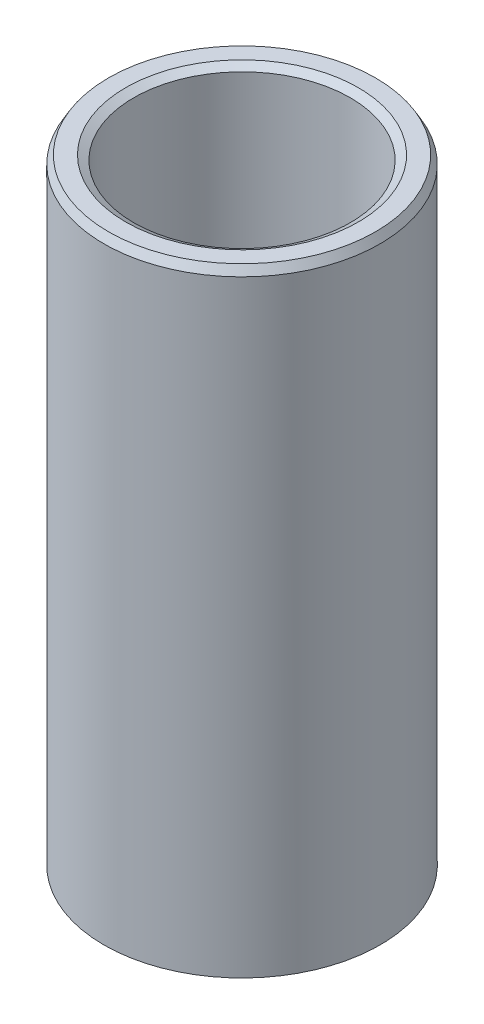
ISO-10303-21;
HEADER;
FILE_DESCRIPTION(('STEP AP214'),'2;1');
FILE_NAME('part.step','',(''),(''),'','','');
FILE_SCHEMA(('AUTOMOTIVE_DESIGN { 1 0 10303 214 1 1 1 1 }'));
ENDSEC;
DATA;
#1=APPLICATION_CONTEXT('core data for automotive mechanical design processes');
#2=APPLICATION_PROTOCOL_DEFINITION('international standard','automotive_design',2000,#1);
#3=PRODUCT_CONTEXT('',#1,'mechanical');
#4=PRODUCT('Part','Part','',(#3));
#5=PRODUCT_RELATED_PRODUCT_CATEGORY('part','',(#4));
#6=PRODUCT_DEFINITION_FORMATION('','',#4);
#7=PRODUCT_DEFINITION_CONTEXT('part definition',#1,'design');
#8=PRODUCT_DEFINITION('design','',#6,#7);
#9=PRODUCT_DEFINITION_SHAPE('','',#8);
#10=(LENGTH_UNIT() NAMED_UNIT(*) SI_UNIT(.MILLI.,.METRE.));
#11=(NAMED_UNIT(*) PLANE_ANGLE_UNIT() SI_UNIT($,.RADIAN.));
#12=(NAMED_UNIT(*) SI_UNIT($,.STERADIAN.) SOLID_ANGLE_UNIT());
#13=UNCERTAINTY_MEASURE_WITH_UNIT(LENGTH_MEASURE(1.E-05),#10,'distance_accuracy_value','');
#14=(GEOMETRIC_REPRESENTATION_CONTEXT(3) GLOBAL_UNCERTAINTY_ASSIGNED_CONTEXT((#13)) GLOBAL_UNIT_ASSIGNED_CONTEXT((#10,
#11,#12)) REPRESENTATION_CONTEXT('',''));
#15=CARTESIAN_POINT('',(0.,0.,0.));
#16=DIRECTION('',(0.,0.,1.));
#17=DIRECTION('',(1.,0.,0.));
#18=AXIS2_PLACEMENT_3D('',#15,#16,#17);
#19=CARTESIAN_POINT('',(0.,168.357929233188,0.));
#20=DIRECTION('',(0.,-1.,0.));
#21=DIRECTION('',(0.,0.,-1.));
#22=AXIS2_PLACEMENT_3D('',#19,#20,#21);
#23=CYLINDRICAL_SURFACE('',#22,37.5);
#24=CARTESIAN_POINT('',(0.,1.2661300001568,0.));
#25=DIRECTION('',(0.,1.,0.));
#26=DIRECTION('',(0.,0.,1.));
#27=AXIS2_PLACEMENT_3D('',#24,#25,#26);
#28=CIRCLE('',#27,37.5);
#29=CARTESIAN_POINT('',(0.,1.2661300001568,37.5));
#30=VERTEX_POINT('',#29);
#31=EDGE_CURVE('E10',#30,#30,#28,.T.);
#32=ORIENTED_EDGE('',*,*,#31,.T.);
#33=EDGE_LOOP('',(#32));
#34=FACE_BOUND('',#33,.T.);
#35=CARTESIAN_POINT('',(0.,166.164927743929,0.));
#36=DIRECTION('',(0.,1.,0.));
#37=DIRECTION('',(0.,0.,1.));
#38=AXIS2_PLACEMENT_3D('',#35,#36,#37);
#39=CIRCLE('',#38,37.5);
#40=CARTESIAN_POINT('',(0.,166.164927743929,-37.5));
#41=VERTEX_POINT('',#40);
#42=EDGE_CURVE('E50',#41,#41,#39,.F.);
#43=ORIENTED_EDGE('',*,*,#42,.T.);
#44=EDGE_LOOP('',(#43));
#45=FACE_BOUND('',#44,.T.);
#46=ADVANCED_FACE('F39',(#34,#45),#23,.T.);
#47=CARTESIAN_POINT('',(0.,168.357929233188,0.));
#48=DIRECTION('',(0.,1.,0.));
#49=DIRECTION('',(0.,0.,1.));
#50=AXIS2_PLACEMENT_3D('',#47,#48,#49);
#51=PLANE('',#50);
#52=CARTESIAN_POINT('',(0.,168.357929233188,0.));
#53=DIRECTION('',(0.,1.,0.));
#54=DIRECTION('',(0.,0.,1.));
#55=AXIS2_PLACEMENT_3D('',#52,#53,#54);
#56=CIRCLE('',#55,31.6012845616972);
#57=CARTESIAN_POINT('',(0.,168.357929233188,31.6012845616972));
#58=VERTEX_POINT('',#57);
#59=EDGE_CURVE('E58',#58,#58,#56,.F.);
#60=ORIENTED_EDGE('',*,*,#59,.T.);
#61=EDGE_LOOP('',(#60));
#62=FACE_BOUND('',#61,.T.);
#63=CARTESIAN_POINT('',(0.,168.357929233188,0.));
#64=DIRECTION('',(0.,1.,0.));
#65=DIRECTION('',(0.,0.,1.));
#66=AXIS2_PLACEMENT_3D('',#63,#64,#65);
#67=CIRCLE('',#66,36.2338699998432);
#68=CARTESIAN_POINT('',(0.,168.357929233188,-36.2338699998432));
#69=VERTEX_POINT('',#68);
#70=EDGE_CURVE('E61',#69,#69,#67,.T.);
#71=ORIENTED_EDGE('',*,*,#70,.T.);
#72=EDGE_LOOP('',(#71));
#73=FACE_BOUND('',#72,.T.);
#74=ADVANCED_FACE('F88',(#62,#73),#51,.T.);
#75=CARTESIAN_POINT('',(0.,0.,0.));
#76=DIRECTION('',(0.,1.,0.));
#77=DIRECTION('',(0.,0.,1.));
#78=AXIS2_PLACEMENT_3D('',#75,#76,#77);
#79=PLANE('',#78);
#80=CARTESIAN_POINT('',(0.,0.,0.));
#81=DIRECTION('',(0.,1.,0.));
#82=DIRECTION('',(0.,0.,1.));
#83=AXIS2_PLACEMENT_3D('',#80,#81,#82);
#84=CIRCLE('',#83,30.6744130725952);
#85=CARTESIAN_POINT('',(0.,0.,-30.6744130725952));
#86=VERTEX_POINT('',#85);
#87=EDGE_CURVE('E51',#86,#86,#84,.T.);
#88=ORIENTED_EDGE('',*,*,#87,.T.);
#89=EDGE_LOOP('',(#88));
#90=FACE_BOUND('',#89,.T.);
#91=CARTESIAN_POINT('',(0.,0.,0.));
#92=DIRECTION('',(0.,1.,0.));
#93=DIRECTION('',(0.,0.,1.));
#94=AXIS2_PLACEMENT_3D('',#91,#92,#93);
#95=CIRCLE('',#94,35.3069985107412);
#96=CARTESIAN_POINT('',(0.,0.,35.3069985107412));
#97=VERTEX_POINT('',#96);
#98=EDGE_CURVE('E54',#97,#97,#95,.F.);
#99=ORIENTED_EDGE('',*,*,#98,.T.);
#100=EDGE_LOOP('',(#99));
#101=FACE_BOUND('',#100,.T.);
#102=ADVANCED_FACE('F83',(#90,#101),#79,.F.);
#103=CARTESIAN_POINT('',(0.,168.357929233188,0.));
#104=DIRECTION('',(0.,-1.,0.));
#105=DIRECTION('',(0.,0.,-1.));
#106=AXIS2_PLACEMENT_3D('',#103,#104,#105);
#107=CYLINDRICAL_SURFACE('',#106,29.4082830724384);
#108=CARTESIAN_POINT('',(0.,167.091799233031,0.));
#109=DIRECTION('',(0.,1.,0.));
#110=DIRECTION('',(0.,0.,1.));
#111=AXIS2_PLACEMENT_3D('',#108,#109,#110);
#112=CIRCLE('',#111,29.4082830724384);
#113=CARTESIAN_POINT('',(0.,167.091799233031,29.4082830724384));
#114=VERTEX_POINT('',#113);
#115=EDGE_CURVE('E67',#114,#114,#112,.T.);
#116=ORIENTED_EDGE('',*,*,#115,.T.);
#117=EDGE_LOOP('',(#116));
#118=FACE_BOUND('',#117,.T.);
#119=CARTESIAN_POINT('',(0.,2.1930014892588,0.));
#120=DIRECTION('',(0.,1.,0.));
#121=DIRECTION('',(0.,0.,1.));
#122=AXIS2_PLACEMENT_3D('',#119,#120,#121);
#123=CIRCLE('',#122,29.4082830724384);
#124=CARTESIAN_POINT('',(0.,2.1930014892588,-29.4082830724384));
#125=VERTEX_POINT('',#124);
#126=EDGE_CURVE('E69',#125,#125,#123,.F.);
#127=ORIENTED_EDGE('',*,*,#126,.T.);
#128=EDGE_LOOP('',(#127));
#129=FACE_BOUND('',#128,.T.);
#130=ADVANCED_FACE('F71',(#118,#129),#107,.F.);
#131=CARTESIAN_POINT('',(0.,167.091799233031,0.));
#132=DIRECTION('',(0.,1.,0.));
#133=DIRECTION('',(0.,0.,1.));
#134=AXIS2_PLACEMENT_3D('',#131,#132,#133);
#135=CONICAL_SURFACE('',#134,29.4082830724384,1.0471975511966);
#136=ORIENTED_EDGE('',*,*,#59,.F.);
#137=EDGE_LOOP('',(#136));
#138=FACE_BOUND('',#137,.T.);
#139=ORIENTED_EDGE('',*,*,#115,.F.);
#140=EDGE_LOOP('',(#139));
#141=FACE_BOUND('',#140,.T.);
#142=ADVANCED_FACE('F77',(#138,#141),#135,.F.);
#143=CARTESIAN_POINT('',(0.,0.,0.));
#144=DIRECTION('',(0.,-1.,0.));
#145=DIRECTION('',(0.,0.,-1.));
#146=AXIS2_PLACEMENT_3D('',#143,#144,#145);
#147=CONICAL_SURFACE('',#146,30.6744130725952,0.5235987755983);
#148=CARTESIAN_POINT('',(0.,2.1930014892588,-29.4082830724384));
#149=CARTESIAN_POINT('',(0.,2.17015772374569,-29.4214719266067));
#150=CARTESIAN_POINT('',(0.,2.14731395823257,-29.434660780775));
#151=CARTESIAN_POINT('',(0.,2.10162642720635,-29.4610384891116));
#152=CARTESIAN_POINT('',(0.,2.07878266169324,-29.4742273432799));
#153=CARTESIAN_POINT('',(0.,2.03309513066701,-29.5006050516165));
#154=CARTESIAN_POINT('',(0.,2.0102513651539,-29.5137939057848));
#155=CARTESIAN_POINT('',(0.,1.96456383412767,-29.5401716141214));
#156=CARTESIAN_POINT('',(0.,1.94172006861456,-29.5533604682897));
#157=CARTESIAN_POINT('',(0.,1.89603253758834,-29.5797381766263));
#158=CARTESIAN_POINT('',(0.,1.87318877207522,-29.5929270307946));
#159=CARTESIAN_POINT('',(0.,1.827501241049,-29.6193047391312));
#160=CARTESIAN_POINT('',(0.,1.80465747553589,-29.6324935932995));
#161=CARTESIAN_POINT('',(0.,1.75896994450966,-29.6588713016361));
#162=CARTESIAN_POINT('',(0.,1.73612617899655,-29.6720601558044));
#163=CARTESIAN_POINT('',(0.,1.69043864797032,-29.698437864141));
#164=CARTESIAN_POINT('',(0.,1.66759488245721,-29.7116267183093));
#165=CARTESIAN_POINT('',(0.,1.62190735143099,-29.7380044266459));
#166=CARTESIAN_POINT('',(0.,1.59906358591787,-29.7511932808142));
#167=CARTESIAN_POINT('',(0.,1.55337605489165,-29.7775709891508));
#168=CARTESIAN_POINT('',(0.,1.53053228937854,-29.7907598433191));
#169=CARTESIAN_POINT('',(0.,1.48484475835231,-29.8171375516557));
#170=CARTESIAN_POINT('',(0.,1.4620009928392,-29.830326405824));
#171=CARTESIAN_POINT('',(0.,1.41631346181297,-29.8567041141606));
#172=CARTESIAN_POINT('',(0.,1.39346969629986,-29.8698929683289));
#173=CARTESIAN_POINT('',(0.,1.34778216527364,-29.8962706766655));
#174=CARTESIAN_POINT('',(0.,1.32493839976052,-29.9094595308338));
#175=CARTESIAN_POINT('',(0.,1.2792508687343,-29.9358372391704));
#176=CARTESIAN_POINT('',(0.,1.25640710322119,-29.9490260933387));
#177=CARTESIAN_POINT('',(0.,1.21071957219496,-29.9754038016753));
#178=CARTESIAN_POINT('',(0.,1.18787580668185,-29.9885926558436));
#179=CARTESIAN_POINT('',(0.,1.14218827565562,-30.0149703641802));
#180=CARTESIAN_POINT('',(0.,1.11934451014251,-30.0281592183485));
#181=CARTESIAN_POINT('',(0.,1.07365697911629,-30.0545369266851));
#182=CARTESIAN_POINT('',(0.,1.05081321360317,-30.0677257808534));
#183=CARTESIAN_POINT('',(0.,1.00512568257695,-30.09410348919));
#184=CARTESIAN_POINT('',(0.,0.982281917063838,-30.1072923433583));
#185=CARTESIAN_POINT('',(0.,0.936594386037613,-30.1336700516949));
#186=CARTESIAN_POINT('',(0.,0.9137506205245,-30.1468589058632));
#187=CARTESIAN_POINT('',(0.,0.868063089498275,-30.1732366141998));
#188=CARTESIAN_POINT('',(0.,0.845219323985162,-30.1864254683681));
#189=CARTESIAN_POINT('',(0.,0.799531792958938,-30.2128031767047));
#190=CARTESIAN_POINT('',(0.,0.776688027445825,-30.225992030873));
#191=CARTESIAN_POINT('',(0.,0.7310004964196,-30.2523697392096));
#192=CARTESIAN_POINT('',(0.,0.708156730906488,-30.2655585933779));
#193=CARTESIAN_POINT('',(0.,0.662469199880263,-30.2919363017145));
#194=CARTESIAN_POINT('',(0.,0.63962543436715,-30.3051251558828));
#195=CARTESIAN_POINT('',(0.,0.593937903340925,-30.3315028642194));
#196=CARTESIAN_POINT('',(0.,0.571094137827812,-30.3446917183877));
#197=CARTESIAN_POINT('',(0.,0.525406606801587,-30.3710694267243));
#198=CARTESIAN_POINT('',(0.,0.502562841288475,-30.3842582808926));
#199=CARTESIAN_POINT('',(0.,0.45687531026225,-30.4106359892292));
#200=CARTESIAN_POINT('',(0.,0.434031544749138,-30.4238248433975));
#201=CARTESIAN_POINT('',(0.,0.388344013722913,-30.4502025517341));
#202=CARTESIAN_POINT('',(0.,0.3655002482098,-30.4633914059024));
#203=CARTESIAN_POINT('',(0.,0.319812717183575,-30.489769114239));
#204=CARTESIAN_POINT('',(0.,0.296968951670462,-30.5029579684073));
#205=CARTESIAN_POINT('',(0.,0.251281420644238,-30.5293356767439));
#206=CARTESIAN_POINT('',(0.,0.228437655131125,-30.5425245309122));
#207=CARTESIAN_POINT('',(0.,0.1827501241049,-30.5689022392488));
#208=CARTESIAN_POINT('',(0.,0.159906358591788,-30.5820910934171));
#209=CARTESIAN_POINT('',(0.,0.114218827565563,-30.6084688017537));
#210=CARTESIAN_POINT('',(0.,0.09137506205245,-30.621657655922));
#211=CARTESIAN_POINT('',(0.,0.0456875310262245,-30.6480353642586));
#212=CARTESIAN_POINT('',(0.,0.0228437655131118,-30.6612242184269));
#213=CARTESIAN_POINT('',(0.,0.,-30.6744130725952));
#214=B_SPLINE_CURVE_WITH_KNOTS('',3,(#148,#149,#150,#151,#152,#153,#154,#155,#156,#157,#158,
#159,#160,#161,#162,#163,#164,#165,#166,#167,#168,#169,#170,#171,#172,#173,#174,#175,#176,#177,
#178,#179,#180,#181,#182,#183,#184,#185,#186,#187,#188,#189,#190,#191,#192,#193,#194,#195,#196,
#197,#198,#199,#200,#201,#202,#203,#204,#205,#206,#207,#208,#209,#210,#211,#212,#213),
.UNSPECIFIED.,.F.,.F.,(4,2,2,2,2,2,2,2,2,2,2,2,2,2,2,2,2,2,2,2,2,2,2,2,2,2,2,2,2,2,2,2,4),(0.,
0.0791331250098017,0.158266250019603,0.237399375029403,0.316532500039205,0.395665625049006,
0.474798750058808,0.553931875068608,0.63306500007841,0.712198125088211,0.791331250098013,
0.870464375107813,0.949597500117615,1.02873062512742,1.10786375013722,1.18699687514702,
1.26613000015682,1.34526312516662,1.42439625017642,1.50352937518622,1.58266250019602,
1.66179562520583,1.74092875021563,1.82006187522543,1.89919500023523,1.97832812524503,
2.05746125025483,2.13659437526463,2.21572750027443,2.29486062528423,2.37399375029404,
2.45312687530384,2.53226000031364),.UNSPECIFIED.);
#215=EDGE_CURVE('BSEAM73',#125,#86,#214,.T.);
#216=ORIENTED_EDGE('',*,*,#126,.F.);
#217=ORIENTED_EDGE('',*,*,#87,.F.);
#218=ORIENTED_EDGE('',*,*,#215,.T.);
#219=ORIENTED_EDGE('',*,*,#215,.F.);
#220=EDGE_LOOP('',(#216,#218,#217,#219));
#221=FACE_BOUND('',#220,.T.);
#222=ADVANCED_FACE('F73',(#221),#147,.F.);
#223=CARTESIAN_POINT('',(0.,1.2661300001568,0.));
#224=DIRECTION('',(0.,1.,0.));
#225=DIRECTION('',(0.,0.,1.));
#226=AXIS2_PLACEMENT_3D('',#223,#224,#225);
#227=CONICAL_SURFACE('',#226,37.5,1.04719755119661);
#228=ORIENTED_EDGE('',*,*,#98,.F.);
#229=EDGE_LOOP('',(#228));
#230=FACE_BOUND('',#229,.T.);
#231=ORIENTED_EDGE('',*,*,#31,.F.);
#232=EDGE_LOOP('',(#231));
#233=FACE_BOUND('',#232,.T.);
#234=ADVANCED_FACE('F76',(#230,#233),#227,.T.);
#235=CARTESIAN_POINT('',(0.,168.357929233188,0.));
#236=DIRECTION('',(0.,-1.,0.));
#237=DIRECTION('',(0.,0.,-1.));
#238=AXIS2_PLACEMENT_3D('',#235,#236,#237);
#239=CONICAL_SURFACE('',#238,36.2338699998432,0.523598775598296);
#240=CARTESIAN_POINT('',(0.,166.164927743929,-37.5));
#241=CARTESIAN_POINT('',(0.,166.187771509442,-37.4868111458317));
#242=CARTESIAN_POINT('',(0.,166.210615274955,-37.4736222916634));
#243=CARTESIAN_POINT('',(0.,166.256302805981,-37.4472445833268));
#244=CARTESIAN_POINT('',(0.,166.279146571494,-37.4340557291585));
#245=CARTESIAN_POINT('',(0.,166.32483410252,-37.4076780208219));
#246=CARTESIAN_POINT('',(0.,166.347677868034,-37.3944891666536));
#247=CARTESIAN_POINT('',(0.,166.39336539906,-37.368111458317));
#248=CARTESIAN_POINT('',(0.,166.416209164573,-37.3549226041487));
#249=CARTESIAN_POINT('',(0.,166.461896695599,-37.3285448958121));
#250=CARTESIAN_POINT('',(0.,166.484740461112,-37.3153560416438));
#251=CARTESIAN_POINT('',(0.,166.530427992139,-37.2889783333072));
#252=CARTESIAN_POINT('',(0.,166.553271757652,-37.2757894791389));
#253=CARTESIAN_POINT('',(0.,166.598959288678,-37.2494117708023));
#254=CARTESIAN_POINT('',(0.,166.621803054191,-37.236222916634));
#255=CARTESIAN_POINT('',(0.,166.667490585217,-37.2098452082974));
#256=CARTESIAN_POINT('',(0.,166.69033435073,-37.1966563541291));
#257=CARTESIAN_POINT('',(0.,166.736021881756,-37.1702786457925));
#258=CARTESIAN_POINT('',(0.,166.75886564727,-37.1570897916242));
#259=CARTESIAN_POINT('',(0.,166.804553178296,-37.1307120832876));
#260=CARTESIAN_POINT('',(0.,166.827396943809,-37.1175232291193));
#261=CARTESIAN_POINT('',(0.,166.873084474835,-37.0911455207827));
#262=CARTESIAN_POINT('',(0.,166.895928240348,-37.0779566666144));
#263=CARTESIAN_POINT('',(0.,166.941615771375,-37.0515789582778));
#264=CARTESIAN_POINT('',(0.,166.964459536888,-37.0383901041095));
#265=CARTESIAN_POINT('',(0.,167.010147067914,-37.0120123957729));
#266=CARTESIAN_POINT('',(0.,167.032990833427,-36.9988235416046));
#267=CARTESIAN_POINT('',(0.,167.078678364453,-36.972445833268));
#268=CARTESIAN_POINT('',(0.,167.101522129966,-36.9592569790997));
#269=CARTESIAN_POINT('',(0.,167.147209660993,-36.9328792707631));
#270=CARTESIAN_POINT('',(0.,167.170053426506,-36.9196904165948));
#271=CARTESIAN_POINT('',(0.,167.215740957532,-36.8933127082582));
#272=CARTESIAN_POINT('',(0.,167.238584723045,-36.8801238540899));
#273=CARTESIAN_POINT('',(0.,167.284272254071,-36.8537461457533));
#274=CARTESIAN_POINT('',(0.,167.307116019584,-36.840557291585));
#275=CARTESIAN_POINT('',(0.,167.352803550611,-36.8141795832484));
#276=CARTESIAN_POINT('',(0.,167.375647316124,-36.8009907290801));
#277=CARTESIAN_POINT('',(0.,167.42133484715,-36.7746130207435));
#278=CARTESIAN_POINT('',(0.,167.444178612663,-36.7614241665752));
#279=CARTESIAN_POINT('',(0.,167.489866143689,-36.7350464582386));
#280=CARTESIAN_POINT('',(0.,167.512709909202,-36.7218576040703));
#281=CARTESIAN_POINT('',(0.,167.558397440229,-36.6954798957337));
#282=CARTESIAN_POINT('',(0.,167.581241205742,-36.6822910415654));
#283=CARTESIAN_POINT('',(0.,167.626928736768,-36.6559133332288));
#284=CARTESIAN_POINT('',(0.,167.649772502281,-36.6427244790605));
#285=CARTESIAN_POINT('',(0.,167.695460033307,-36.6163467707239));
#286=CARTESIAN_POINT('',(0.,167.71830379882,-36.6031579165556));
#287=CARTESIAN_POINT('',(0.,167.763991329847,-36.576780208219));
#288=CARTESIAN_POINT('',(0.,167.78683509536,-36.5635913540507));
#289=CARTESIAN_POINT('',(0.,167.832522626386,-36.5372136457141));
#290=CARTESIAN_POINT('',(0.,167.855366391899,-36.5240247915458));
#291=CARTESIAN_POINT('',(0.,167.901053922925,-36.4976470832092));
#292=CARTESIAN_POINT('',(0.,167.923897688438,-36.4844582290409));
#293=CARTESIAN_POINT('',(0.,167.969585219465,-36.4580805207043));
#294=CARTESIAN_POINT('',(0.,167.992428984978,-36.444891666536));
#295=CARTESIAN_POINT('',(0.,168.038116516004,-36.4185139581994));
#296=CARTESIAN_POINT('',(0.,168.060960281517,-36.4053251040311));
#297=CARTESIAN_POINT('',(0.,168.106647812543,-36.3789473956945));
#298=CARTESIAN_POINT('',(0.,168.129491578056,-36.3657585415262));
#299=CARTESIAN_POINT('',(0.,168.175179109083,-36.3393808331896));
#300=CARTESIAN_POINT('',(0.,168.198022874596,-36.3261919790213));
#301=CARTESIAN_POINT('',(0.,168.243710405622,-36.2998142706847));
#302=CARTESIAN_POINT('',(0.,168.266554171135,-36.2866254165164));
#303=CARTESIAN_POINT('',(0.,168.312241702161,-36.2602477081798));
#304=CARTESIAN_POINT('',(0.,168.335085467674,-36.2470588540115));
#305=CARTESIAN_POINT('',(0.,168.357929233188,-36.2338699998432));
#306=B_SPLINE_CURVE_WITH_KNOTS('',3,(#240,#241,#242,#243,#244,#245,#246,#247,#248,#249,#250,
#251,#252,#253,#254,#255,#256,#257,#258,#259,#260,#261,#262,#263,#264,#265,#266,#267,#268,#269,
#270,#271,#272,#273,#274,#275,#276,#277,#278,#279,#280,#281,#282,#283,#284,#285,#286,#287,#288,
#289,#290,#291,#292,#293,#294,#295,#296,#297,#298,#299,#300,#301,#302,#303,#304,#305),
.UNSPECIFIED.,.F.,.F.,(4,2,2,2,2,2,2,2,2,2,2,2,2,2,2,2,2,2,2,2,2,2,2,2,2,2,2,2,2,2,2,2,4),(0.,
0.0791331250098204,0.158266250019613,0.23739937502941,0.316532500039206,0.395665625049027,
0.474798750058823,0.553931875068616,0.633065000078412,0.712198125088209,0.791331250098029,
0.870464375107826,0.949597500117622,1.02873062512742,1.10786375013724,1.18699687514703,
1.26613000015683,1.34526312516663,1.42439625017642,1.50352937518624,1.58266250019604,
1.66179562520583,1.74092875021563,1.82006187522545,1.89919500023524,1.97832812524504,
2.05746125025483,2.13659437526463,2.21572750027445,2.29486062528424,2.37399375029404,
2.45312687530384,2.53226000031366),.UNSPECIFIED.);
#307=EDGE_CURVE('BSEAM45',#41,#69,#306,.T.);
#308=ORIENTED_EDGE('',*,*,#42,.F.);
#309=ORIENTED_EDGE('',*,*,#70,.F.);
#310=ORIENTED_EDGE('',*,*,#307,.T.);
#311=ORIENTED_EDGE('',*,*,#307,.F.);
#312=EDGE_LOOP('',(#308,#310,#309,#311));
#313=FACE_BOUND('',#312,.T.);
#314=ADVANCED_FACE('F45',(#313),#239,.T.);
#315=CLOSED_SHELL('',(#46,#74,#102,#130,#142,#222,#234,#314));
#316=MANIFOLD_SOLID_BREP('B2',#315);
#317=ADVANCED_BREP_SHAPE_REPRESENTATION('',(#18,#316),#14);
#318=SHAPE_DEFINITION_REPRESENTATION(#9,#317);
ENDSEC;
END-ISO-10303-21;
